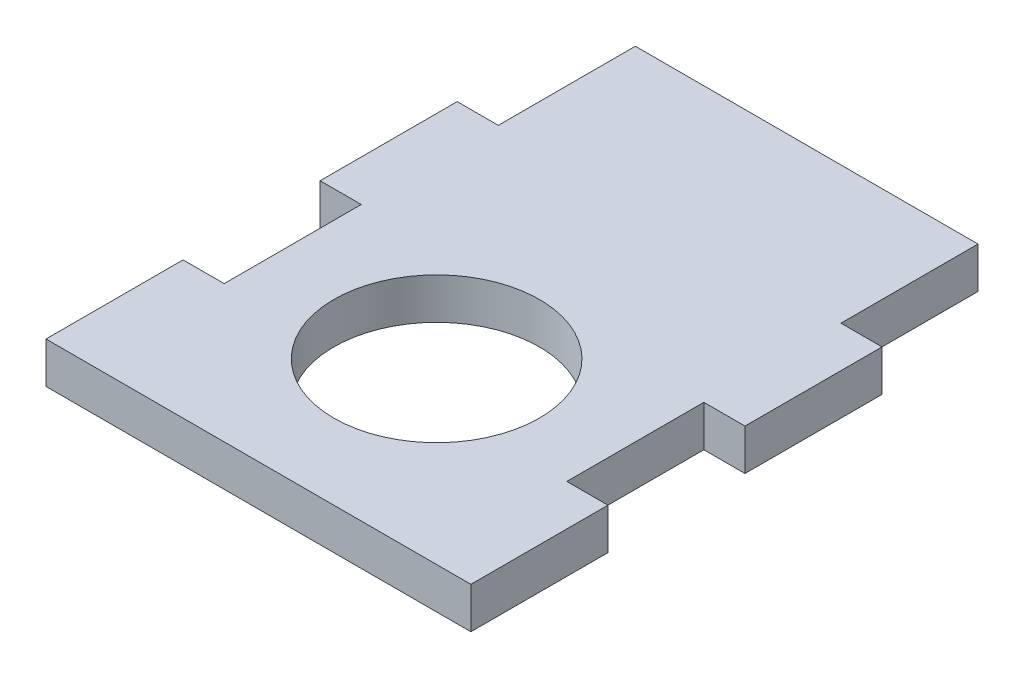
ISO-10303-21;
HEADER;
FILE_DESCRIPTION(('STEP AP214'),'2;1');
FILE_NAME('part.step','',(''),(''),'','','');
FILE_SCHEMA(('AUTOMOTIVE_DESIGN { 1 0 10303 214 1 1 1 1 }'));
ENDSEC;
DATA;
#1=APPLICATION_CONTEXT('core data for automotive mechanical design processes');
#2=APPLICATION_PROTOCOL_DEFINITION('international standard','automotive_design',2000,#1);
#3=PRODUCT_CONTEXT('',#1,'mechanical');
#4=PRODUCT('Part','Part','',(#3));
#5=PRODUCT_RELATED_PRODUCT_CATEGORY('part','',(#4));
#6=PRODUCT_DEFINITION_FORMATION('','',#4);
#7=PRODUCT_DEFINITION_CONTEXT('part definition',#1,'design');
#8=PRODUCT_DEFINITION('design','',#6,#7);
#9=PRODUCT_DEFINITION_SHAPE('','',#8);
#10=(LENGTH_UNIT() NAMED_UNIT(*) SI_UNIT(.MILLI.,.METRE.));
#11=(NAMED_UNIT(*) PLANE_ANGLE_UNIT() SI_UNIT($,.RADIAN.));
#12=(NAMED_UNIT(*) SI_UNIT($,.STERADIAN.) SOLID_ANGLE_UNIT());
#13=UNCERTAINTY_MEASURE_WITH_UNIT(LENGTH_MEASURE(1.E-05),#10,'distance_accuracy_value','');
#14=(GEOMETRIC_REPRESENTATION_CONTEXT(3) GLOBAL_UNCERTAINTY_ASSIGNED_CONTEXT((#13)) GLOBAL_UNIT_ASSIGNED_CONTEXT((#10,
#11,#12)) REPRESENTATION_CONTEXT('',''));
#15=CARTESIAN_POINT('',(0.,0.,0.));
#16=DIRECTION('',(0.,0.,1.));
#17=DIRECTION('',(1.,0.,0.));
#18=AXIS2_PLACEMENT_3D('',#15,#16,#17);
#19=CARTESIAN_POINT('',(-12.5,3.,20.));
#20=DIRECTION('',(1.,0.,0.));
#21=DIRECTION('',(0.,0.,-1.));
#22=AXIS2_PLACEMENT_3D('',#19,#20,#21);
#23=PLANE('',#22);
#24=DIRECTION('',(0.,0.,1.));
#25=VECTOR('',#24,1.);
#26=CARTESIAN_POINT('',(-12.5,3.,20.));
#27=LINE('',#26,#25);
#28=CARTESIAN_POINT('',(-12.5,3.,0.));
#29=VERTEX_POINT('',#28);
#30=CARTESIAN_POINT('',(-12.5,3.,10.));
#31=VERTEX_POINT('',#30);
#32=EDGE_CURVE('E50',#29,#31,#27,.T.);
#33=ORIENTED_EDGE('',*,*,#32,.F.);
#34=DIRECTION('',(0.,1.,0.));
#35=VECTOR('',#34,1.);
#36=CARTESIAN_POINT('',(-12.5,-10.4403065089106,0.));
#37=LINE('',#36,#35);
#38=CARTESIAN_POINT('',(-12.5,0.,0.));
#39=VERTEX_POINT('',#38);
#40=EDGE_CURVE('E173',#39,#29,#37,.T.);
#41=ORIENTED_EDGE('',*,*,#40,.F.);
#42=DIRECTION('',(0.,0.,1.));
#43=VECTOR('',#42,1.);
#44=CARTESIAN_POINT('',(-12.5,0.,20.));
#45=LINE('',#44,#43);
#46=CARTESIAN_POINT('',(-12.5,0.,10.));
#47=VERTEX_POINT('',#46);
#48=EDGE_CURVE('E201',#39,#47,#45,.T.);
#49=ORIENTED_EDGE('',*,*,#48,.T.);
#50=DIRECTION('',(0.,1.,0.));
#51=VECTOR('',#50,1.);
#52=CARTESIAN_POINT('',(-12.5,-10.4403065089106,10.));
#53=LINE('',#52,#51);
#54=EDGE_CURVE('E190',#47,#31,#53,.T.);
#55=ORIENTED_EDGE('',*,*,#54,.T.);
#56=EDGE_LOOP('',(#33,#41,#49,#55));
#57=FACE_BOUND('',#56,.T.);
#58=ADVANCED_FACE('F33',(#57),#23,.F.);
#59=CARTESIAN_POINT('',(12.5,3.,20.));
#60=DIRECTION('',(-1.,0.,0.));
#61=DIRECTION('',(0.,0.,1.));
#62=AXIS2_PLACEMENT_3D('',#59,#60,#61);
#63=PLANE('',#62);
#64=DIRECTION('',(0.,0.,-1.));
#65=VECTOR('',#64,1.);
#66=CARTESIAN_POINT('',(12.5,3.,20.));
#67=LINE('',#66,#65);
#68=CARTESIAN_POINT('',(12.5,3.,-10.));
#69=VERTEX_POINT('',#68);
#70=CARTESIAN_POINT('',(12.5,3.,-20.));
#71=VERTEX_POINT('',#70);
#72=EDGE_CURVE('E217',#69,#71,#67,.T.);
#73=ORIENTED_EDGE('',*,*,#72,.F.);
#74=DIRECTION('',(0.,1.,0.));
#75=VECTOR('',#74,1.);
#76=CARTESIAN_POINT('',(12.5,-10.4403065089106,-10.));
#77=LINE('',#76,#75);
#78=CARTESIAN_POINT('',(12.5,0.,-10.));
#79=VERTEX_POINT('',#78);
#80=EDGE_CURVE('E381',#79,#69,#77,.T.);
#81=ORIENTED_EDGE('',*,*,#80,.F.);
#82=DIRECTION('',(0.,0.,-1.));
#83=VECTOR('',#82,1.);
#84=CARTESIAN_POINT('',(12.5,0.,20.));
#85=LINE('',#84,#83);
#86=CARTESIAN_POINT('',(12.5,0.,-20.));
#87=VERTEX_POINT('',#86);
#88=EDGE_CURVE('E275',#79,#87,#85,.T.);
#89=ORIENTED_EDGE('',*,*,#88,.T.);
#90=DIRECTION('',(0.,-1.,0.));
#91=VECTOR('',#90,1.);
#92=CARTESIAN_POINT('',(12.5,3.,-20.));
#93=LINE('',#92,#91);
#94=EDGE_CURVE('E11',#71,#87,#93,.T.);
#95=ORIENTED_EDGE('',*,*,#94,.F.);
#96=EDGE_LOOP('',(#73,#81,#89,#95));
#97=FACE_BOUND('',#96,.T.);
#98=ADVANCED_FACE('F297',(#97),#63,.F.);
#99=CARTESIAN_POINT('',(12.5,0.,10.));
#100=VERTEX_POINT('',#99);
#101=CARTESIAN_POINT('',(12.5,0.,0.));
#102=VERTEX_POINT('',#101);
#103=EDGE_CURVE('E233',#100,#102,#85,.T.);
#104=ORIENTED_EDGE('',*,*,#103,.T.);
#105=DIRECTION('',(0.,1.,0.));
#106=VECTOR('',#105,1.);
#107=CARTESIAN_POINT('',(12.5,-10.4403065089106,0.));
#108=LINE('',#107,#106);
#109=CARTESIAN_POINT('',(12.5,3.,0.));
#110=VERTEX_POINT('',#109);
#111=EDGE_CURVE('E267',#102,#110,#108,.T.);
#112=ORIENTED_EDGE('',*,*,#111,.T.);
#113=CARTESIAN_POINT('',(12.5,3.,10.));
#114=VERTEX_POINT('',#113);
#115=EDGE_CURVE('E229',#114,#110,#67,.T.);
#116=ORIENTED_EDGE('',*,*,#115,.F.);
#117=DIRECTION('',(0.,1.,0.));
#118=VECTOR('',#117,1.);
#119=CARTESIAN_POINT('',(12.5,-10.4403065089106,10.));
#120=LINE('',#119,#118);
#121=EDGE_CURVE('E234',#100,#114,#120,.T.);
#122=ORIENTED_EDGE('',*,*,#121,.F.);
#123=EDGE_LOOP('',(#104,#112,#116,#122));
#124=FACE_BOUND('',#123,.T.);
#125=ADVANCED_FACE('F292',(#124),#63,.F.);
#126=CARTESIAN_POINT('',(-12.5,0.,-20.));
#127=VERTEX_POINT('',#126);
#128=CARTESIAN_POINT('',(-12.5,0.,-10.));
#129=VERTEX_POINT('',#128);
#130=EDGE_CURVE('E203',#127,#129,#45,.T.);
#131=ORIENTED_EDGE('',*,*,#130,.T.);
#132=DIRECTION('',(0.,1.,0.));
#133=VECTOR('',#132,1.);
#134=CARTESIAN_POINT('',(-12.5,-10.4403065089106,-10.));
#135=LINE('',#134,#133);
#136=CARTESIAN_POINT('',(-12.5,3.,-10.));
#137=VERTEX_POINT('',#136);
#138=EDGE_CURVE('E58',#129,#137,#135,.T.);
#139=ORIENTED_EDGE('',*,*,#138,.T.);
#140=CARTESIAN_POINT('',(-12.5,3.,-20.));
#141=VERTEX_POINT('',#140);
#142=EDGE_CURVE('E167',#141,#137,#27,.T.);
#143=ORIENTED_EDGE('',*,*,#142,.F.);
#144=DIRECTION('',(0.,-1.,0.));
#145=VECTOR('',#144,1.);
#146=CARTESIAN_POINT('',(-12.5,3.,-20.));
#147=LINE('',#146,#145);
#148=EDGE_CURVE('E42',#141,#127,#147,.T.);
#149=ORIENTED_EDGE('',*,*,#148,.T.);
#150=EDGE_LOOP('',(#131,#139,#143,#149));
#151=FACE_BOUND('',#150,.T.);
#152=ADVANCED_FACE('F35',(#151),#23,.F.);
#153=CARTESIAN_POINT('',(12.5,3.,20.));
#154=DIRECTION('',(0.,0.,-1.));
#155=DIRECTION('',(-1.,0.,0.));
#156=AXIS2_PLACEMENT_3D('',#153,#154,#155);
#157=PLANE('',#156);
#158=DIRECTION('',(1.,0.,0.));
#159=VECTOR('',#158,1.);
#160=CARTESIAN_POINT('',(12.5,0.,20.));
#161=LINE('',#160,#159);
#162=CARTESIAN_POINT('',(-15.5,0.,20.));
#163=VERTEX_POINT('',#162);
#164=CARTESIAN_POINT('',(15.5,0.,20.));
#165=VERTEX_POINT('',#164);
#166=EDGE_CURVE('E211',#163,#165,#161,.T.);
#167=ORIENTED_EDGE('',*,*,#166,.T.);
#168=DIRECTION('',(0.,1.,0.));
#169=VECTOR('',#168,1.);
#170=CARTESIAN_POINT('',(15.5,-10.4403065089106,20.));
#171=LINE('',#170,#169);
#172=CARTESIAN_POINT('',(15.5,3.,20.));
#173=VERTEX_POINT('',#172);
#174=EDGE_CURVE('E223',#165,#173,#171,.T.);
#175=ORIENTED_EDGE('',*,*,#174,.T.);
#176=DIRECTION('',(1.,0.,0.));
#177=VECTOR('',#176,1.);
#178=CARTESIAN_POINT('',(12.5,3.,20.));
#179=LINE('',#178,#177);
#180=CARTESIAN_POINT('',(-15.5,3.,20.));
#181=VERTEX_POINT('',#180);
#182=EDGE_CURVE('E219',#181,#173,#179,.T.);
#183=ORIENTED_EDGE('',*,*,#182,.F.);
#184=DIRECTION('',(0.,1.,0.));
#185=VECTOR('',#184,1.);
#186=CARTESIAN_POINT('',(-15.5,-10.4403065089106,20.));
#187=LINE('',#186,#185);
#188=EDGE_CURVE('E187',#163,#181,#187,.T.);
#189=ORIENTED_EDGE('',*,*,#188,.F.);
#190=EDGE_LOOP('',(#167,#175,#183,#189));
#191=FACE_BOUND('',#190,.T.);
#192=ADVANCED_FACE('F291',(#191),#157,.F.);
#193=CARTESIAN_POINT('',(12.5,3.,-20.));
#194=DIRECTION('',(0.,0.,1.));
#195=DIRECTION('',(1.,0.,0.));
#196=AXIS2_PLACEMENT_3D('',#193,#194,#195);
#197=PLANE('',#196);
#198=DIRECTION('',(-1.,0.,0.));
#199=VECTOR('',#198,1.);
#200=CARTESIAN_POINT('',(12.5,0.,-20.));
#201=LINE('',#200,#199);
#202=EDGE_CURVE('E278',#87,#127,#201,.T.);
#203=ORIENTED_EDGE('',*,*,#202,.T.);
#204=ORIENTED_EDGE('',*,*,#148,.F.);
#205=DIRECTION('',(-1.,0.,0.));
#206=VECTOR('',#205,1.);
#207=CARTESIAN_POINT('',(12.5,3.,-20.));
#208=LINE('',#207,#206);
#209=EDGE_CURVE('E209',#71,#141,#208,.T.);
#210=ORIENTED_EDGE('',*,*,#209,.F.);
#211=ORIENTED_EDGE('',*,*,#94,.T.);
#212=EDGE_LOOP('',(#203,#204,#210,#211));
#213=FACE_BOUND('',#212,.T.);
#214=ADVANCED_FACE('F288',(#213),#197,.F.);
#215=CARTESIAN_POINT('',(0.,3.,0.));
#216=DIRECTION('',(0.,1.,0.));
#217=DIRECTION('',(0.,0.,1.));
#218=AXIS2_PLACEMENT_3D('',#215,#216,#217);
#219=PLANE('',#218);
#220=CARTESIAN_POINT('',(0.,3.,7.));
#221=DIRECTION('',(0.,1.,0.));
#222=DIRECTION('',(0.,0.,1.));
#223=AXIS2_PLACEMENT_3D('',#220,#221,#222);
#224=CIRCLE('',#223,7.5);
#225=CARTESIAN_POINT('',(0.,3.,14.5));
#226=VERTEX_POINT('',#225);
#227=EDGE_CURVE('E360',#226,#226,#224,.T.);
#228=ORIENTED_EDGE('',*,*,#227,.F.);
#229=EDGE_LOOP('',(#228));
#230=FACE_BOUND('',#229,.T.);
#231=ORIENTED_EDGE('',*,*,#142,.T.);
#232=DIRECTION('',(-1.,0.,0.));
#233=VECTOR('',#232,1.);
#234=CARTESIAN_POINT('',(-12.5,3.,-10.));
#235=LINE('',#234,#233);
#236=CARTESIAN_POINT('',(-15.5,3.,-10.));
#237=VERTEX_POINT('',#236);
#238=EDGE_CURVE('E154',#137,#237,#235,.T.);
#239=ORIENTED_EDGE('',*,*,#238,.T.);
#240=DIRECTION('',(0.,0.,1.));
#241=VECTOR('',#240,1.);
#242=CARTESIAN_POINT('',(-15.5,3.,0.));
#243=LINE('',#242,#241);
#244=CARTESIAN_POINT('',(-15.5,3.,0.));
#245=VERTEX_POINT('',#244);
#246=EDGE_CURVE('E166',#237,#245,#243,.T.);
#247=ORIENTED_EDGE('',*,*,#246,.T.);
#248=DIRECTION('',(1.,0.,0.));
#249=VECTOR('',#248,1.);
#250=CARTESIAN_POINT('',(-12.5,3.,0.));
#251=LINE('',#250,#249);
#252=EDGE_CURVE('E168',#245,#29,#251,.T.);
#253=ORIENTED_EDGE('',*,*,#252,.T.);
#254=ORIENTED_EDGE('',*,*,#32,.T.);
#255=DIRECTION('',(-1.,0.,0.));
#256=VECTOR('',#255,1.);
#257=CARTESIAN_POINT('',(-12.5,3.,10.));
#258=LINE('',#257,#256);
#259=CARTESIAN_POINT('',(-15.5,3.,10.));
#260=VERTEX_POINT('',#259);
#261=EDGE_CURVE('E184',#31,#260,#258,.T.);
#262=ORIENTED_EDGE('',*,*,#261,.T.);
#263=DIRECTION('',(0.,0.,1.));
#264=VECTOR('',#263,1.);
#265=CARTESIAN_POINT('',(-15.5,3.,10.));
#266=LINE('',#265,#264);
#267=EDGE_CURVE('E180',#260,#181,#266,.T.);
#268=ORIENTED_EDGE('',*,*,#267,.T.);
#269=ORIENTED_EDGE('',*,*,#182,.T.);
#270=DIRECTION('',(0.,0.,-1.));
#271=VECTOR('',#270,1.);
#272=CARTESIAN_POINT('',(15.5,3.,10.));
#273=LINE('',#272,#271);
#274=CARTESIAN_POINT('',(15.5,3.,10.));
#275=VERTEX_POINT('',#274);
#276=EDGE_CURVE('E244',#173,#275,#273,.T.);
#277=ORIENTED_EDGE('',*,*,#276,.T.);
#278=DIRECTION('',(-1.,0.,0.));
#279=VECTOR('',#278,1.);
#280=CARTESIAN_POINT('',(12.5,3.,10.));
#281=LINE('',#280,#279);
#282=EDGE_CURVE('E240',#275,#114,#281,.T.);
#283=ORIENTED_EDGE('',*,*,#282,.T.);
#284=ORIENTED_EDGE('',*,*,#115,.T.);
#285=DIRECTION('',(1.,0.,0.));
#286=VECTOR('',#285,1.);
#287=CARTESIAN_POINT('',(12.5,3.,0.));
#288=LINE('',#287,#286);
#289=CARTESIAN_POINT('',(15.5,3.,0.));
#290=VERTEX_POINT('',#289);
#291=EDGE_CURVE('E380',#110,#290,#288,.T.);
#292=ORIENTED_EDGE('',*,*,#291,.T.);
#293=DIRECTION('',(0.,0.,-1.));
#294=VECTOR('',#293,1.);
#295=CARTESIAN_POINT('',(15.5,3.,0.));
#296=LINE('',#295,#294);
#297=CARTESIAN_POINT('',(15.5,3.,-10.));
#298=VERTEX_POINT('',#297);
#299=EDGE_CURVE('E385',#290,#298,#296,.T.);
#300=ORIENTED_EDGE('',*,*,#299,.T.);
#301=DIRECTION('',(-1.,0.,0.));
#302=VECTOR('',#301,1.);
#303=CARTESIAN_POINT('',(12.5,3.,-10.));
#304=LINE('',#303,#302);
#305=EDGE_CURVE('E388',#298,#69,#304,.T.);
#306=ORIENTED_EDGE('',*,*,#305,.T.);
#307=ORIENTED_EDGE('',*,*,#72,.T.);
#308=ORIENTED_EDGE('',*,*,#209,.T.);
#309=EDGE_LOOP('',(#231,#239,#247,#253,#254,#262,#268,#269,#277,#283,#284,#292,#300,#306,#307,#308));
#310=FACE_BOUND('',#309,.T.);
#311=ADVANCED_FACE('F164',(#230,#310),#219,.T.);
#312=CARTESIAN_POINT('',(0.,0.,0.));
#313=DIRECTION('',(0.,1.,0.));
#314=DIRECTION('',(0.,0.,1.));
#315=AXIS2_PLACEMENT_3D('',#312,#313,#314);
#316=PLANE('',#315);
#317=CARTESIAN_POINT('',(0.,0.,7.));
#318=DIRECTION('',(0.,1.,0.));
#319=DIRECTION('',(0.,0.,1.));
#320=AXIS2_PLACEMENT_3D('',#317,#318,#319);
#321=CIRCLE('',#320,7.5);
#322=CARTESIAN_POINT('',(0.,0.,14.5));
#323=VERTEX_POINT('',#322);
#324=EDGE_CURVE('E37',#323,#323,#321,.T.);
#325=ORIENTED_EDGE('',*,*,#324,.T.);
#326=EDGE_LOOP('',(#325));
#327=FACE_BOUND('',#326,.T.);
#328=ORIENTED_EDGE('',*,*,#130,.F.);
#329=ORIENTED_EDGE('',*,*,#202,.F.);
#330=ORIENTED_EDGE('',*,*,#88,.F.);
#331=DIRECTION('',(1.,0.,0.));
#332=VECTOR('',#331,1.);
#333=CARTESIAN_POINT('',(12.5,0.,-10.));
#334=LINE('',#333,#332);
#335=CARTESIAN_POINT('',(15.5,0.,-10.));
#336=VERTEX_POINT('',#335);
#337=EDGE_CURVE('E258',#79,#336,#334,.T.);
#338=ORIENTED_EDGE('',*,*,#337,.T.);
#339=DIRECTION('',(0.,0.,1.));
#340=VECTOR('',#339,1.);
#341=CARTESIAN_POINT('',(15.5,0.,0.));
#342=LINE('',#341,#340);
#343=CARTESIAN_POINT('',(15.5,0.,0.));
#344=VERTEX_POINT('',#343);
#345=EDGE_CURVE('E264',#336,#344,#342,.T.);
#346=ORIENTED_EDGE('',*,*,#345,.T.);
#347=DIRECTION('',(-1.,0.,0.));
#348=VECTOR('',#347,1.);
#349=CARTESIAN_POINT('',(12.5,0.,0.));
#350=LINE('',#349,#348);
#351=EDGE_CURVE('E256',#344,#102,#350,.T.);
#352=ORIENTED_EDGE('',*,*,#351,.T.);
#353=ORIENTED_EDGE('',*,*,#103,.F.);
#354=DIRECTION('',(1.,0.,0.));
#355=VECTOR('',#354,1.);
#356=CARTESIAN_POINT('',(12.5,0.,10.));
#357=LINE('',#356,#355);
#358=CARTESIAN_POINT('',(15.5,0.,10.));
#359=VERTEX_POINT('',#358);
#360=EDGE_CURVE('E204',#100,#359,#357,.T.);
#361=ORIENTED_EDGE('',*,*,#360,.T.);
#362=DIRECTION('',(0.,0.,1.));
#363=VECTOR('',#362,1.);
#364=CARTESIAN_POINT('',(15.5,0.,10.));
#365=LINE('',#364,#363);
#366=EDGE_CURVE('E238',#359,#165,#365,.T.);
#367=ORIENTED_EDGE('',*,*,#366,.T.);
#368=ORIENTED_EDGE('',*,*,#166,.F.);
#369=DIRECTION('',(0.,0.,-1.));
#370=VECTOR('',#369,1.);
#371=CARTESIAN_POINT('',(-15.5,0.,10.));
#372=LINE('',#371,#370);
#373=CARTESIAN_POINT('',(-15.5,0.,10.));
#374=VERTEX_POINT('',#373);
#375=EDGE_CURVE('E198',#163,#374,#372,.T.);
#376=ORIENTED_EDGE('',*,*,#375,.T.);
#377=DIRECTION('',(1.,0.,0.));
#378=VECTOR('',#377,1.);
#379=CARTESIAN_POINT('',(-12.5,0.,10.));
#380=LINE('',#379,#378);
#381=EDGE_CURVE('E193',#374,#47,#380,.T.);
#382=ORIENTED_EDGE('',*,*,#381,.T.);
#383=ORIENTED_EDGE('',*,*,#48,.F.);
#384=DIRECTION('',(-1.,0.,0.));
#385=VECTOR('',#384,1.);
#386=CARTESIAN_POINT('',(-12.5,0.,0.));
#387=LINE('',#386,#385);
#388=CARTESIAN_POINT('',(-15.5,0.,0.));
#389=VERTEX_POINT('',#388);
#390=EDGE_CURVE('E368',#39,#389,#387,.T.);
#391=ORIENTED_EDGE('',*,*,#390,.T.);
#392=DIRECTION('',(0.,0.,-1.));
#393=VECTOR('',#392,1.);
#394=CARTESIAN_POINT('',(-15.5,0.,0.));
#395=LINE('',#394,#393);
#396=CARTESIAN_POINT('',(-15.5,0.,-10.));
#397=VERTEX_POINT('',#396);
#398=EDGE_CURVE('E366',#389,#397,#395,.T.);
#399=ORIENTED_EDGE('',*,*,#398,.T.);
#400=DIRECTION('',(1.,0.,0.));
#401=VECTOR('',#400,1.);
#402=CARTESIAN_POINT('',(-12.5,0.,-10.));
#403=LINE('',#402,#401);
#404=EDGE_CURVE('E156',#397,#129,#403,.T.);
#405=ORIENTED_EDGE('',*,*,#404,.T.);
#406=EDGE_LOOP('',(#328,#329,#330,#338,#346,#352,#353,#361,#367,#368,#376,#382,#383,#391,#399,#405));
#407=FACE_BOUND('',#406,.T.);
#408=ADVANCED_FACE('F310',(#327,#407),#316,.F.);
#409=CARTESIAN_POINT('',(12.5,-10.4403065089106,10.));
#410=DIRECTION('',(0.,0.,-1.));
#411=DIRECTION('',(-1.,0.,0.));
#412=AXIS2_PLACEMENT_3D('',#409,#410,#411);
#413=PLANE('',#412);
#414=ORIENTED_EDGE('',*,*,#360,.F.);
#415=ORIENTED_EDGE('',*,*,#121,.T.);
#416=ORIENTED_EDGE('',*,*,#282,.F.);
#417=DIRECTION('',(0.,1.,0.));
#418=VECTOR('',#417,1.);
#419=CARTESIAN_POINT('',(15.5,-10.4403065089106,10.));
#420=LINE('',#419,#418);
#421=EDGE_CURVE('E239',#359,#275,#420,.T.);
#422=ORIENTED_EDGE('',*,*,#421,.F.);
#423=EDGE_LOOP('',(#414,#415,#416,#422));
#424=FACE_BOUND('',#423,.T.);
#425=ADVANCED_FACE('F313',(#424),#413,.T.);
#426=CARTESIAN_POINT('',(15.5,-10.4403065089106,10.));
#427=DIRECTION('',(1.,0.,0.));
#428=DIRECTION('',(0.,0.,-1.));
#429=AXIS2_PLACEMENT_3D('',#426,#427,#428);
#430=PLANE('',#429);
#431=ORIENTED_EDGE('',*,*,#366,.F.);
#432=ORIENTED_EDGE('',*,*,#421,.T.);
#433=ORIENTED_EDGE('',*,*,#276,.F.);
#434=ORIENTED_EDGE('',*,*,#174,.F.);
#435=EDGE_LOOP('',(#431,#432,#433,#434));
#436=FACE_BOUND('',#435,.T.);
#437=ADVANCED_FACE('F318',(#436),#430,.T.);
#438=CARTESIAN_POINT('',(12.5,-10.4403065089106,-10.));
#439=DIRECTION('',(0.,0.,-1.));
#440=DIRECTION('',(-1.,0.,0.));
#441=AXIS2_PLACEMENT_3D('',#438,#439,#440);
#442=PLANE('',#441);
#443=ORIENTED_EDGE('',*,*,#337,.F.);
#444=ORIENTED_EDGE('',*,*,#80,.T.);
#445=ORIENTED_EDGE('',*,*,#305,.F.);
#446=DIRECTION('',(0.,1.,0.));
#447=VECTOR('',#446,1.);
#448=CARTESIAN_POINT('',(15.5,-10.4403065089106,-10.));
#449=LINE('',#448,#447);
#450=EDGE_CURVE('E392',#336,#298,#449,.T.);
#451=ORIENTED_EDGE('',*,*,#450,.F.);
#452=EDGE_LOOP('',(#443,#444,#445,#451));
#453=FACE_BOUND('',#452,.T.);
#454=ADVANCED_FACE('F321',(#453),#442,.T.);
#455=CARTESIAN_POINT('',(15.5,-10.4403065089106,0.));
#456=DIRECTION('',(1.,0.,0.));
#457=DIRECTION('',(0.,0.,-1.));
#458=AXIS2_PLACEMENT_3D('',#455,#456,#457);
#459=PLANE('',#458);
#460=ORIENTED_EDGE('',*,*,#345,.F.);
#461=ORIENTED_EDGE('',*,*,#450,.T.);
#462=ORIENTED_EDGE('',*,*,#299,.F.);
#463=DIRECTION('',(0.,1.,0.));
#464=VECTOR('',#463,1.);
#465=CARTESIAN_POINT('',(15.5,-10.4403065089106,0.));
#466=LINE('',#465,#464);
#467=EDGE_CURVE('E393',#344,#290,#466,.T.);
#468=ORIENTED_EDGE('',*,*,#467,.F.);
#469=EDGE_LOOP('',(#460,#461,#462,#468));
#470=FACE_BOUND('',#469,.T.);
#471=ADVANCED_FACE('F329',(#470),#459,.T.);
#472=CARTESIAN_POINT('',(12.5,-10.4403065089106,0.));
#473=DIRECTION('',(0.,0.,1.));
#474=DIRECTION('',(1.,0.,0.));
#475=AXIS2_PLACEMENT_3D('',#472,#473,#474);
#476=PLANE('',#475);
#477=ORIENTED_EDGE('',*,*,#351,.F.);
#478=ORIENTED_EDGE('',*,*,#467,.T.);
#479=ORIENTED_EDGE('',*,*,#291,.F.);
#480=ORIENTED_EDGE('',*,*,#111,.F.);
#481=EDGE_LOOP('',(#477,#478,#479,#480));
#482=FACE_BOUND('',#481,.T.);
#483=ADVANCED_FACE('F325',(#482),#476,.T.);
#484=CARTESIAN_POINT('',(-12.5,-10.4403065089106,10.));
#485=DIRECTION('',(0.,0.,-1.));
#486=DIRECTION('',(-1.,0.,0.));
#487=AXIS2_PLACEMENT_3D('',#484,#485,#486);
#488=PLANE('',#487);
#489=ORIENTED_EDGE('',*,*,#381,.F.);
#490=DIRECTION('',(0.,1.,0.));
#491=VECTOR('',#490,1.);
#492=CARTESIAN_POINT('',(-15.5,-10.4403065089106,10.));
#493=LINE('',#492,#491);
#494=EDGE_CURVE('E183',#374,#260,#493,.T.);
#495=ORIENTED_EDGE('',*,*,#494,.T.);
#496=ORIENTED_EDGE('',*,*,#261,.F.);
#497=ORIENTED_EDGE('',*,*,#54,.F.);
#498=EDGE_LOOP('',(#489,#495,#496,#497));
#499=FACE_BOUND('',#498,.T.);
#500=ADVANCED_FACE('F328',(#499),#488,.T.);
#501=CARTESIAN_POINT('',(-15.5,-10.4403065089106,10.));
#502=DIRECTION('',(-1.,0.,0.));
#503=DIRECTION('',(0.,0.,1.));
#504=AXIS2_PLACEMENT_3D('',#501,#502,#503);
#505=PLANE('',#504);
#506=ORIENTED_EDGE('',*,*,#375,.F.);
#507=ORIENTED_EDGE('',*,*,#188,.T.);
#508=ORIENTED_EDGE('',*,*,#267,.F.);
#509=ORIENTED_EDGE('',*,*,#494,.F.);
#510=EDGE_LOOP('',(#506,#507,#508,#509));
#511=FACE_BOUND('',#510,.T.);
#512=ADVANCED_FACE('F339',(#511),#505,.T.);
#513=CARTESIAN_POINT('',(-12.5,-10.4403065089106,0.));
#514=DIRECTION('',(0.,0.,1.));
#515=DIRECTION('',(1.,0.,0.));
#516=AXIS2_PLACEMENT_3D('',#513,#514,#515);
#517=PLANE('',#516);
#518=ORIENTED_EDGE('',*,*,#390,.F.);
#519=ORIENTED_EDGE('',*,*,#40,.T.);
#520=ORIENTED_EDGE('',*,*,#252,.F.);
#521=DIRECTION('',(0.,1.,0.));
#522=VECTOR('',#521,1.);
#523=CARTESIAN_POINT('',(-15.5,-10.4403065089106,0.));
#524=LINE('',#523,#522);
#525=EDGE_CURVE('E160',#389,#245,#524,.T.);
#526=ORIENTED_EDGE('',*,*,#525,.F.);
#527=EDGE_LOOP('',(#518,#519,#520,#526));
#528=FACE_BOUND('',#527,.T.);
#529=ADVANCED_FACE('F343',(#528),#517,.T.);
#530=CARTESIAN_POINT('',(-15.5,-10.4403065089106,0.));
#531=DIRECTION('',(-1.,0.,0.));
#532=DIRECTION('',(0.,0.,1.));
#533=AXIS2_PLACEMENT_3D('',#530,#531,#532);
#534=PLANE('',#533);
#535=ORIENTED_EDGE('',*,*,#398,.F.);
#536=ORIENTED_EDGE('',*,*,#525,.T.);
#537=ORIENTED_EDGE('',*,*,#246,.F.);
#538=DIRECTION('',(0.,1.,0.));
#539=VECTOR('',#538,1.);
#540=CARTESIAN_POINT('',(-15.5,-10.4403065089106,-10.));
#541=LINE('',#540,#539);
#542=EDGE_CURVE('E151',#397,#237,#541,.T.);
#543=ORIENTED_EDGE('',*,*,#542,.F.);
#544=EDGE_LOOP('',(#535,#536,#537,#543));
#545=FACE_BOUND('',#544,.T.);
#546=ADVANCED_FACE('F170',(#545),#534,.T.);
#547=CARTESIAN_POINT('',(-12.5,-10.4403065089106,-10.));
#548=DIRECTION('',(0.,0.,-1.));
#549=DIRECTION('',(-1.,0.,0.));
#550=AXIS2_PLACEMENT_3D('',#547,#548,#549);
#551=PLANE('',#550);
#552=ORIENTED_EDGE('',*,*,#404,.F.);
#553=ORIENTED_EDGE('',*,*,#542,.T.);
#554=ORIENTED_EDGE('',*,*,#238,.F.);
#555=ORIENTED_EDGE('',*,*,#138,.F.);
#556=EDGE_LOOP('',(#552,#553,#554,#555));
#557=FACE_BOUND('',#556,.T.);
#558=ADVANCED_FACE('F153',(#557),#551,.T.);
#559=CARTESIAN_POINT('',(0.,-5.00000000001367E-05,7.));
#560=DIRECTION('',(0.,1.,0.));
#561=DIRECTION('',(0.,0.,1.));
#562=AXIS2_PLACEMENT_3D('',#559,#560,#561);
#563=CYLINDRICAL_SURFACE('',#562,7.5);
#564=ORIENTED_EDGE('',*,*,#227,.T.);
#565=EDGE_LOOP('',(#564));
#566=FACE_BOUND('',#565,.T.);
#567=ORIENTED_EDGE('',*,*,#324,.F.);
#568=EDGE_LOOP('',(#567));
#569=FACE_BOUND('',#568,.T.);
#570=ADVANCED_FACE('F350',(#566,#569),#563,.F.);
#571=CLOSED_SHELL('',(#58,#98,#125,#152,#192,#214,#311,#408,#425,#437,#454,#471,#483,#500,#512,
#529,#546,#558,#570));
#572=MANIFOLD_SOLID_BREP('B2',#571);
#573=ADVANCED_BREP_SHAPE_REPRESENTATION('',(#18,#572),#14);
#574=SHAPE_DEFINITION_REPRESENTATION(#9,#573);
ENDSEC;
END-ISO-10303-21;
